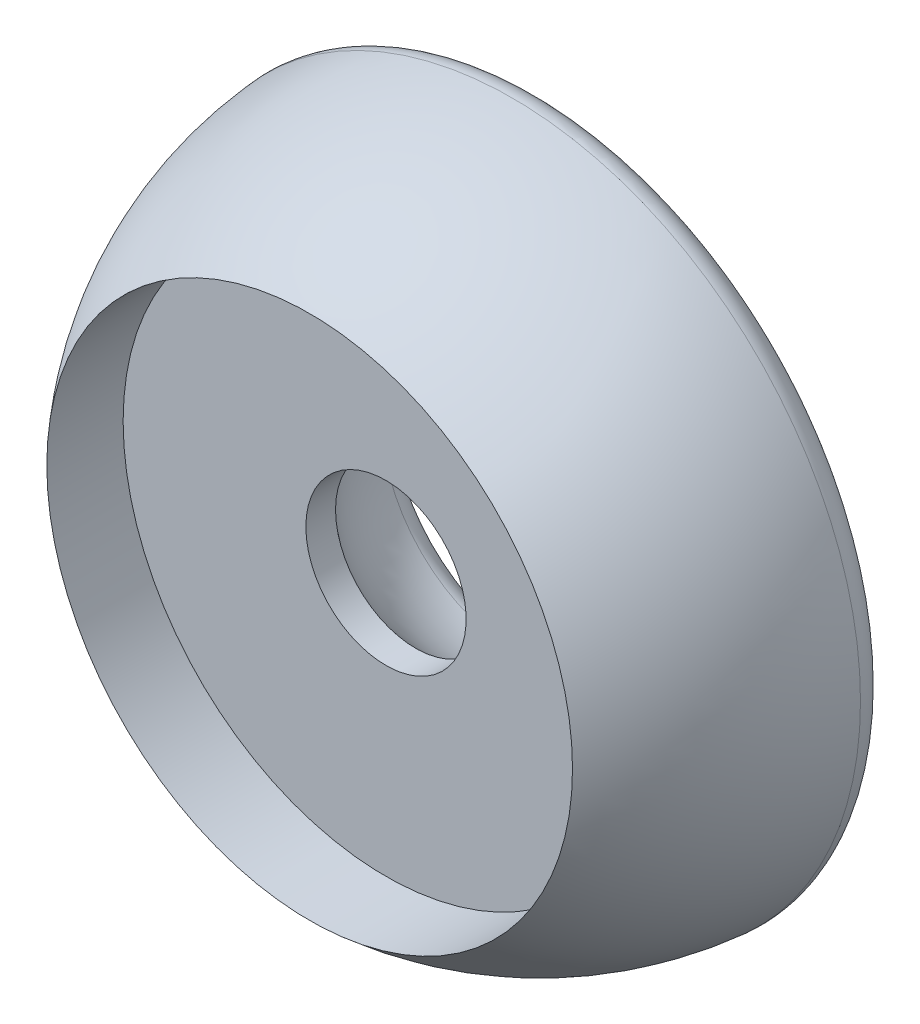
ISO-10303-21;
HEADER;
FILE_DESCRIPTION(('STEP AP214'),'2;1');
FILE_NAME('part.step','',(''),(''),'','','');
FILE_SCHEMA(('AUTOMOTIVE_DESIGN { 1 0 10303 214 1 1 1 1 }'));
ENDSEC;
DATA;
#1=APPLICATION_CONTEXT('core data for automotive mechanical design processes');
#2=APPLICATION_PROTOCOL_DEFINITION('international standard','automotive_design',2000,#1);
#3=PRODUCT_CONTEXT('',#1,'mechanical');
#4=PRODUCT('Part','Part','',(#3));
#5=PRODUCT_RELATED_PRODUCT_CATEGORY('part','',(#4));
#6=PRODUCT_DEFINITION_FORMATION('','',#4);
#7=PRODUCT_DEFINITION_CONTEXT('part definition',#1,'design');
#8=PRODUCT_DEFINITION('design','',#6,#7);
#9=PRODUCT_DEFINITION_SHAPE('','',#8);
#10=(LENGTH_UNIT() NAMED_UNIT(*) SI_UNIT(.MILLI.,.METRE.));
#11=(NAMED_UNIT(*) PLANE_ANGLE_UNIT() SI_UNIT($,.RADIAN.));
#12=(NAMED_UNIT(*) SI_UNIT($,.STERADIAN.) SOLID_ANGLE_UNIT());
#13=UNCERTAINTY_MEASURE_WITH_UNIT(LENGTH_MEASURE(1.E-05),#10,'distance_accuracy_value','');
#14=(GEOMETRIC_REPRESENTATION_CONTEXT(3) GLOBAL_UNCERTAINTY_ASSIGNED_CONTEXT((#13)) GLOBAL_UNIT_ASSIGNED_CONTEXT((#10,
#11,#12)) REPRESENTATION_CONTEXT('',''));
#15=CARTESIAN_POINT('',(0.,0.,0.));
#16=DIRECTION('',(0.,0.,1.));
#17=DIRECTION('',(1.,0.,0.));
#18=AXIS2_PLACEMENT_3D('',#15,#16,#17);
#19=CARTESIAN_POINT('',(0.,0.,0.2));
#20=DIRECTION('',(0.,0.,-1.));
#21=DIRECTION('',(-1.,0.,0.));
#22=AXIS2_PLACEMENT_3D('',#19,#20,#21);
#23=DEGENERATE_TOROIDAL_SURFACE('',#22,0.0999999999999998,2.2,.F.);
#24=CARTESIAN_POINT('',(0.,0.,0.369230769230769));
#25=DIRECTION('',(0.,0.,-1.));
#26=DIRECTION('',(-1.,0.,0.));
#27=AXIS2_PLACEMENT_3D('',#24,#25,#26);
#28=CIRCLE('',#27,2.09348146715343);
#29=CARTESIAN_POINT('',(-2.09348146715343,0.,0.369230769230769));
#30=VERTEX_POINT('',#29);
#31=EDGE_CURVE('E10',#30,#30,#28,.T.);
#32=ORIENTED_EDGE('',*,*,#31,.T.);
#33=EDGE_LOOP('',(#32));
#34=FACE_BOUND('',#33,.T.);
#35=CARTESIAN_POINT('',(0.,0.,1.93709527660402));
#36=DIRECTION('',(0.,0.,-1.));
#37=DIRECTION('',(-1.,0.,0.));
#38=AXIS2_PLACEMENT_3D('',#35,#36,#37);
#39=CIRCLE('',#38,1.25);
#40=CARTESIAN_POINT('',(-1.25,0.,1.93709527660402));
#41=VERTEX_POINT('',#40);
#42=EDGE_CURVE('E50',#41,#41,#39,.T.);
#43=ORIENTED_EDGE('',*,*,#42,.F.);
#44=EDGE_LOOP('',(#43));
#45=FACE_BOUND('',#44,.T.);
#46=ADVANCED_FACE('F30',(#34,#45),#23,.T.);
#47=CARTESIAN_POINT('',(0.,0.,0.));
#48=DIRECTION('',(0.,0.,-1.));
#49=DIRECTION('',(-1.,0.,0.));
#50=AXIS2_PLACEMENT_3D('',#47,#48,#49);
#51=CYLINDRICAL_SURFACE('',#50,1.25);
#52=CARTESIAN_POINT('',(0.,0.,2.4));
#53=DIRECTION('',(0.,0.,-1.));
#54=DIRECTION('',(-1.,0.,0.));
#55=AXIS2_PLACEMENT_3D('',#52,#53,#54);
#56=CIRCLE('',#55,1.25);
#57=CARTESIAN_POINT('',(-1.25,0.,2.4));
#58=VERTEX_POINT('',#57);
#59=EDGE_CURVE('E53',#58,#58,#56,.T.);
#60=ORIENTED_EDGE('',*,*,#59,.F.);
#61=EDGE_LOOP('',(#60));
#62=FACE_BOUND('',#61,.T.);
#63=ORIENTED_EDGE('',*,*,#42,.T.);
#64=EDGE_LOOP('',(#63));
#65=FACE_BOUND('',#64,.T.);
#66=ADVANCED_FACE('F74',(#62,#65),#51,.F.);
#67=CARTESIAN_POINT('',(1.25,0.,2.4));
#68=DIRECTION('',(0.,0.,-1.));
#69=DIRECTION('',(-1.,0.,0.));
#70=AXIS2_PLACEMENT_3D('',#67,#68,#69);
#71=PLANE('',#70);
#72=CARTESIAN_POINT('',(0.,0.,2.4));
#73=DIRECTION('',(0.,0.,-1.));
#74=DIRECTION('',(-1.,0.,0.));
#75=AXIS2_PLACEMENT_3D('',#72,#73,#74);
#76=CIRCLE('',#75,4.1);
#77=CARTESIAN_POINT('',(-4.1,0.,2.4));
#78=VERTEX_POINT('',#77);
#79=EDGE_CURVE('E56',#78,#78,#76,.T.);
#80=ORIENTED_EDGE('',*,*,#79,.F.);
#81=EDGE_LOOP('',(#80));
#82=FACE_BOUND('',#81,.T.);
#83=ORIENTED_EDGE('',*,*,#59,.T.);
#84=EDGE_LOOP('',(#83));
#85=FACE_BOUND('',#84,.T.);
#86=ADVANCED_FACE('F68',(#82,#85),#71,.F.);
#87=CARTESIAN_POINT('',(0.,0.,0.));
#88=DIRECTION('',(0.,0.,-1.));
#89=DIRECTION('',(-1.,0.,0.));
#90=AXIS2_PLACEMENT_3D('',#87,#88,#89);
#91=CYLINDRICAL_SURFACE('',#90,4.1);
#92=CARTESIAN_POINT('',(0.,0.,3.59061276107575));
#93=DIRECTION('',(0.,0.,-1.));
#94=DIRECTION('',(-1.,0.,0.));
#95=AXIS2_PLACEMENT_3D('',#92,#93,#94);
#96=CIRCLE('',#95,4.1);
#97=CARTESIAN_POINT('',(-4.1,0.,3.59061276107575));
#98=VERTEX_POINT('',#97);
#99=EDGE_CURVE('E59',#98,#98,#96,.T.);
#100=ORIENTED_EDGE('',*,*,#99,.F.);
#101=EDGE_LOOP('',(#100));
#102=FACE_BOUND('',#101,.T.);
#103=ORIENTED_EDGE('',*,*,#79,.T.);
#104=EDGE_LOOP('',(#103));
#105=FACE_BOUND('',#104,.T.);
#106=ADVANCED_FACE('F65',(#102,#105),#91,.F.);
#107=CARTESIAN_POINT('',(0.,0.,0.));
#108=DIRECTION('',(0.,0.,-1.));
#109=DIRECTION('',(1.,0.,0.));
#110=AXIS2_PLACEMENT_3D('',#107,#108,#109);
#111=SPHERICAL_SURFACE('',#110,5.45);
#112=CARTESIAN_POINT('',(0.,0.,0.431683168316832));
#113=DIRECTION('',(0.,0.,-1.));
#114=DIRECTION('',(-1.,0.,0.));
#115=AXIS2_PLACEMENT_3D('',#112,#113,#114);
#116=CIRCLE('',#115,5.43287673725366);
#117=CARTESIAN_POINT('',(-5.43287673725366,0.,0.431683168316832));
#118=VERTEX_POINT('',#117);
#119=EDGE_CURVE('E37',#118,#118,#116,.F.);
#120=ORIENTED_EDGE('',*,*,#119,.T.);
#121=EDGE_LOOP('',(#120));
#122=FACE_BOUND('',#121,.T.);
#123=ORIENTED_EDGE('',*,*,#99,.T.);
#124=EDGE_LOOP('',(#123));
#125=FACE_BOUND('',#124,.T.);
#126=ADVANCED_FACE('F63',(#122,#125),#111,.T.);
#127=CARTESIAN_POINT('',(2.1,0.,0.));
#128=DIRECTION('',(0.,0.,1.));
#129=DIRECTION('',(1.,0.,0.));
#130=AXIS2_PLACEMENT_3D('',#127,#128,#129);
#131=PLANE('',#130);
#132=CARTESIAN_POINT('',(0.,0.,0.));
#133=DIRECTION('',(0.,0.,1.));
#134=DIRECTION('',(1.,0.,0.));
#135=AXIS2_PLACEMENT_3D('',#132,#133,#134);
#136=CIRCLE('',#135,5.03413349048275);
#137=CARTESIAN_POINT('',(5.03413349048275,0.,0.));
#138=VERTEX_POINT('',#137);
#139=EDGE_CURVE('E41',#138,#138,#136,.F.);
#140=ORIENTED_EDGE('',*,*,#139,.T.);
#141=EDGE_LOOP('',(#140));
#142=FACE_BOUND('',#141,.T.);
#143=CARTESIAN_POINT('',(0.,0.,0.));
#144=DIRECTION('',(0.,0.,1.));
#145=DIRECTION('',(1.,0.,0.));
#146=AXIS2_PLACEMENT_3D('',#143,#144,#145);
#147=CIRCLE('',#146,2.49229627936314);
#148=CARTESIAN_POINT('',(2.49229627936314,0.,0.));
#149=VERTEX_POINT('',#148);
#150=EDGE_CURVE('E45',#149,#149,#147,.T.);
#151=ORIENTED_EDGE('',*,*,#150,.T.);
#152=EDGE_LOOP('',(#151));
#153=FACE_BOUND('',#152,.T.);
#154=ADVANCED_FACE('F89',(#142,#153),#131,.F.);
#155=CARTESIAN_POINT('',(0.,0.,0.4));
#156=DIRECTION('',(0.,0.,1.));
#157=DIRECTION('',(1.,0.,0.));
#158=AXIS2_PLACEMENT_3D('',#155,#156,#157);
#159=TOROIDAL_SURFACE('',#158,5.03413349048275,0.4);
#160=ORIENTED_EDGE('',*,*,#119,.F.);
#161=EDGE_LOOP('',(#160));
#162=FACE_BOUND('',#161,.T.);
#163=ORIENTED_EDGE('',*,*,#139,.F.);
#164=EDGE_LOOP('',(#163));
#165=FACE_BOUND('',#164,.T.);
#166=ADVANCED_FACE('F87',(#162,#165),#159,.T.);
#167=CARTESIAN_POINT('',(0.,0.,0.4));
#168=DIRECTION('',(0.,0.,1.));
#169=DIRECTION('',(1.,0.,0.));
#170=AXIS2_PLACEMENT_3D('',#167,#168,#169);
#171=TOROIDAL_SURFACE('',#170,2.49229627936314,0.4);
#172=ORIENTED_EDGE('',*,*,#150,.F.);
#173=EDGE_LOOP('',(#172));
#174=FACE_BOUND('',#173,.T.);
#175=ORIENTED_EDGE('',*,*,#31,.F.);
#176=EDGE_LOOP('',(#175));
#177=FACE_BOUND('',#176,.T.);
#178=ADVANCED_FACE('F32',(#174,#177),#171,.T.);
#179=CLOSED_SHELL('',(#46,#66,#86,#106,#126,#154,#166,#178));
#180=MANIFOLD_SOLID_BREP('B2',#179);
#181=ADVANCED_BREP_SHAPE_REPRESENTATION('',(#18,#180),#14);
#182=SHAPE_DEFINITION_REPRESENTATION(#9,#181);
ENDSEC;
END-ISO-10303-21;
